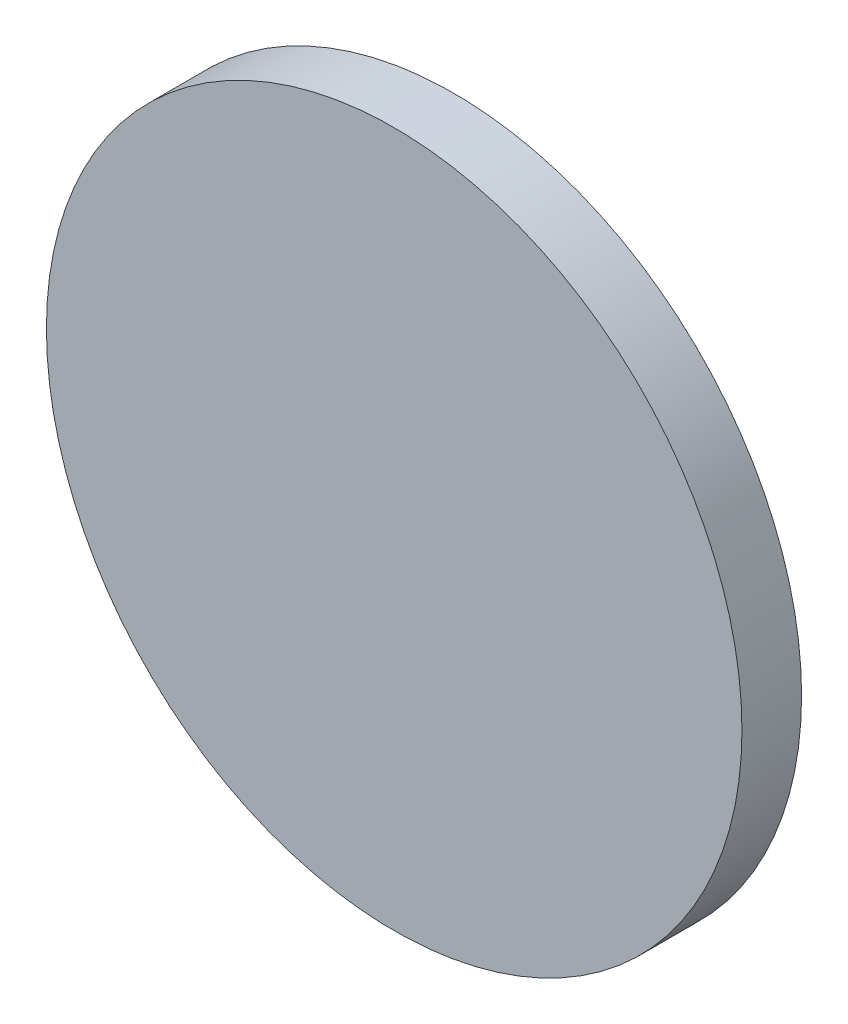
ISO-10303-21;
HEADER;
FILE_DESCRIPTION(('STEP AP214'),'2;1');
FILE_NAME('part.step','',(''),(''),'','','');
FILE_SCHEMA(('AUTOMOTIVE_DESIGN { 1 0 10303 214 1 1 1 1 }'));
ENDSEC;
DATA;
#1=APPLICATION_CONTEXT('core data for automotive mechanical design processes');
#2=APPLICATION_PROTOCOL_DEFINITION('international standard','automotive_design',2000,#1);
#3=PRODUCT_CONTEXT('',#1,'mechanical');
#4=PRODUCT('Part','Part','',(#3));
#5=PRODUCT_RELATED_PRODUCT_CATEGORY('part','',(#4));
#6=PRODUCT_DEFINITION_FORMATION('','',#4);
#7=PRODUCT_DEFINITION_CONTEXT('part definition',#1,'design');
#8=PRODUCT_DEFINITION('design','',#6,#7);
#9=PRODUCT_DEFINITION_SHAPE('','',#8);
#10=(LENGTH_UNIT() NAMED_UNIT(*) SI_UNIT(.MILLI.,.METRE.));
#11=(NAMED_UNIT(*) PLANE_ANGLE_UNIT() SI_UNIT($,.RADIAN.));
#12=(NAMED_UNIT(*) SI_UNIT($,.STERADIAN.) SOLID_ANGLE_UNIT());
#13=UNCERTAINTY_MEASURE_WITH_UNIT(LENGTH_MEASURE(1.E-05),#10,'distance_accuracy_value','');
#14=(GEOMETRIC_REPRESENTATION_CONTEXT(3) GLOBAL_UNCERTAINTY_ASSIGNED_CONTEXT((#13)) GLOBAL_UNIT_ASSIGNED_CONTEXT((#10,
#11,#12)) REPRESENTATION_CONTEXT('',''));
#15=CARTESIAN_POINT('',(0.,0.,0.));
#16=DIRECTION('',(0.,0.,1.));
#17=DIRECTION('',(1.,0.,0.));
#18=AXIS2_PLACEMENT_3D('',#15,#16,#17);
#19=CARTESIAN_POINT('',(5.0165,1.8415,0.));
#20=DIRECTION('',(0.,0.,-1.));
#21=DIRECTION('',(-1.,0.,0.));
#22=AXIS2_PLACEMENT_3D('',#19,#20,#21);
#23=PLANE('',#22);
#24=CARTESIAN_POINT('',(5.0165,1.8415,0.));
#25=DIRECTION('',(0.,0.,1.));
#26=DIRECTION('',(1.,0.,0.));
#27=AXIS2_PLACEMENT_3D('',#24,#25,#26);
#28=CIRCLE('',#27,0.200024667);
#29=CARTESIAN_POINT('',(5.216524667,1.8415,0.));
#30=VERTEX_POINT('',#29);
#31=EDGE_CURVE('E18',#30,#30,#28,.T.);
#32=ORIENTED_EDGE('',*,*,#31,.F.);
#33=EDGE_LOOP('',(#32));
#34=FACE_BOUND('',#33,.T.);
#35=ADVANCED_FACE('F15',(#34),#23,.T.);
#36=CARTESIAN_POINT('',(5.0165,1.8415,0.));
#37=DIRECTION('',(0.,0.,1.));
#38=DIRECTION('',(1.,0.,0.));
#39=AXIS2_PLACEMENT_3D('',#36,#37,#38);
#40=CYLINDRICAL_SURFACE('',#39,0.200024667);
#41=CARTESIAN_POINT('',(5.0165,1.8415,0.03429));
#42=DIRECTION('',(0.,0.,1.));
#43=DIRECTION('',(1.,0.,0.));
#44=AXIS2_PLACEMENT_3D('',#41,#42,#43);
#45=CIRCLE('',#44,0.200024667);
#46=CARTESIAN_POINT('',(5.216524667,1.8415,0.03429));
#47=VERTEX_POINT('',#46);
#48=EDGE_CURVE('E10',#47,#47,#45,.T.);
#49=ORIENTED_EDGE('',*,*,#48,.F.);
#50=EDGE_LOOP('',(#49));
#51=FACE_BOUND('',#50,.T.);
#52=ORIENTED_EDGE('',*,*,#31,.T.);
#53=EDGE_LOOP('',(#52));
#54=FACE_BOUND('',#53,.T.);
#55=ADVANCED_FACE('F27',(#51,#54),#40,.T.);
#56=CARTESIAN_POINT('',(5.0165,1.8415,0.03429));
#57=DIRECTION('',(0.,0.,1.));
#58=DIRECTION('',(1.,0.,0.));
#59=AXIS2_PLACEMENT_3D('',#56,#57,#58);
#60=PLANE('',#59);
#61=ORIENTED_EDGE('',*,*,#48,.T.);
#62=EDGE_LOOP('',(#61));
#63=FACE_BOUND('',#62,.T.);
#64=ADVANCED_FACE('F34',(#63),#60,.T.);
#65=CLOSED_SHELL('',(#35,#55,#64));
#66=MANIFOLD_SOLID_BREP('B1',#65);
#67=ADVANCED_BREP_SHAPE_REPRESENTATION('',(#18,#66),#14);
#68=SHAPE_DEFINITION_REPRESENTATION(#9,#67);
ENDSEC;
END-ISO-10303-21;
